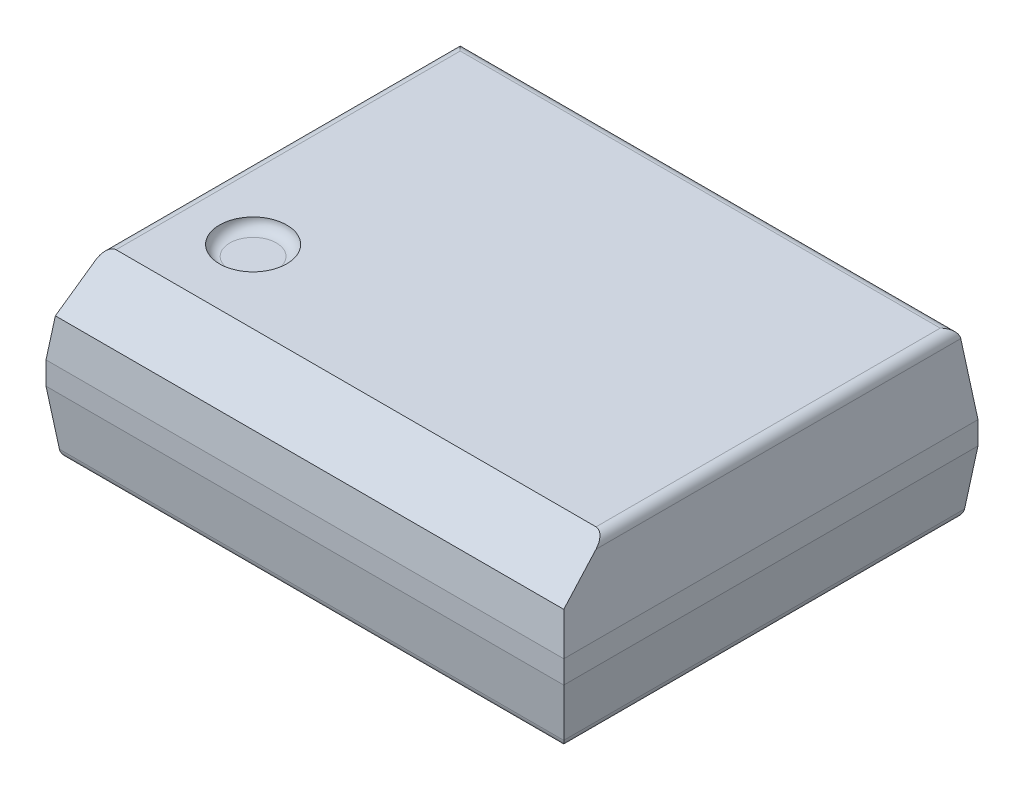
ISO-10303-21;
HEADER;
FILE_DESCRIPTION(('STEP AP214'),'2;1');
FILE_NAME('part.step','',(''),(''),'','','');
FILE_SCHEMA(('AUTOMOTIVE_DESIGN { 1 0 10303 214 1 1 1 1 }'));
ENDSEC;
DATA;
#1=APPLICATION_CONTEXT('core data for automotive mechanical design processes');
#2=APPLICATION_PROTOCOL_DEFINITION('international standard','automotive_design',2000,#1);
#3=PRODUCT_CONTEXT('',#1,'mechanical');
#4=PRODUCT('Part','Part','',(#3));
#5=PRODUCT_RELATED_PRODUCT_CATEGORY('part','',(#4));
#6=PRODUCT_DEFINITION_FORMATION('','',#4);
#7=PRODUCT_DEFINITION_CONTEXT('part definition',#1,'design');
#8=PRODUCT_DEFINITION('design','',#6,#7);
#9=PRODUCT_DEFINITION_SHAPE('','',#8);
#10=(LENGTH_UNIT() NAMED_UNIT(*) SI_UNIT(.MILLI.,.METRE.));
#11=(NAMED_UNIT(*) PLANE_ANGLE_UNIT() SI_UNIT($,.RADIAN.));
#12=(NAMED_UNIT(*) SI_UNIT($,.STERADIAN.) SOLID_ANGLE_UNIT());
#13=UNCERTAINTY_MEASURE_WITH_UNIT(LENGTH_MEASURE(1.E-05),#10,'distance_accuracy_value','');
#14=(GEOMETRIC_REPRESENTATION_CONTEXT(3) GLOBAL_UNCERTAINTY_ASSIGNED_CONTEXT((#13)) GLOBAL_UNIT_ASSIGNED_CONTEXT((#10,
#11,#12)) REPRESENTATION_CONTEXT('',''));
#15=CARTESIAN_POINT('',(0.,0.,0.));
#16=DIRECTION('',(0.,0.,1.));
#17=DIRECTION('',(1.,0.,0.));
#18=AXIS2_PLACEMENT_3D('',#15,#16,#17);
#19=CARTESIAN_POINT('',(-1.7,1.65,0.8));
#20=DIRECTION('',(0.,1.,0.));
#21=DIRECTION('',(0.,0.,1.));
#22=AXIS2_PLACEMENT_3D('',#19,#20,#21);
#23=PLANE('',#22);
#24=CARTESIAN_POINT('',(-1.7,1.65,0.8));
#25=DIRECTION('',(0.,-1.,0.));
#26=DIRECTION('',(1.,0.,0.));
#27=AXIS2_PLACEMENT_3D('',#24,#25,#26);
#28=CIRCLE('',#27,0.225);
#29=CARTESIAN_POINT('',(-1.475,1.65,0.8));
#30=VERTEX_POINT('',#29);
#31=EDGE_CURVE('E152',#30,#30,#28,.F.);
#32=ORIENTED_EDGE('',*,*,#31,.T.);
#33=EDGE_LOOP('',(#32));
#34=FACE_BOUND('',#33,.T.);
#35=ADVANCED_FACE('F16',(#34),#23,.T.);
#36=CARTESIAN_POINT('',(-1.7,1.75,0.8));
#37=DIRECTION('',(0.,1.,0.));
#38=DIRECTION('',(1.,0.,0.));
#39=AXIS2_PLACEMENT_3D('',#36,#37,#38);
#40=TOROIDAL_SURFACE('',#39,0.225,0.1);
#41=ORIENTED_EDGE('',*,*,#31,.F.);
#42=EDGE_LOOP('',(#41));
#43=FACE_BOUND('',#42,.T.);
#44=CARTESIAN_POINT('',(-1.7,1.75,0.8));
#45=DIRECTION('',(0.,1.,0.));
#46=DIRECTION('',(0.,0.,1.));
#47=AXIS2_PLACEMENT_3D('',#44,#45,#46);
#48=CIRCLE('',#47,0.325);
#49=CARTESIAN_POINT('',(-1.7,1.75,1.125));
#50=VERTEX_POINT('',#49);
#51=EDGE_CURVE('E20',#50,#50,#48,.F.);
#52=ORIENTED_EDGE('',*,*,#51,.F.);
#53=EDGE_LOOP('',(#52));
#54=FACE_BOUND('',#53,.T.);
#55=ADVANCED_FACE('F133',(#43,#54),#40,.F.);
#56=CARTESIAN_POINT('',(0.,1.75,0.));
#57=DIRECTION('',(0.,1.,0.));
#58=DIRECTION('',(0.,0.,1.));
#59=AXIS2_PLACEMENT_3D('',#56,#57,#58);
#60=PLANE('',#59);
#61=DIRECTION('',(0.,0.,1.));
#62=VECTOR('',#61,1.);
#63=CARTESIAN_POINT('',(2.31759728445368,1.75,0.));
#64=LINE('',#63,#62);
#65=CARTESIAN_POINT('',(2.31759728445368,1.75,-1.81759728445368));
#66=VERTEX_POINT('',#65);
#67=CARTESIAN_POINT('',(2.31759728445368,1.75,1.50606981090928));
#68=VERTEX_POINT('',#67);
#69=EDGE_CURVE('E87',#66,#68,#64,.T.);
#70=ORIENTED_EDGE('',*,*,#69,.F.);
#71=DIRECTION('',(1.,0.,0.));
#72=VECTOR('',#71,1.);
#73=CARTESIAN_POINT('',(0.,1.75,-1.81759728445368));
#74=LINE('',#73,#72);
#75=CARTESIAN_POINT('',(-2.31759728445368,1.75,-1.81759728445368));
#76=VERTEX_POINT('',#75);
#77=EDGE_CURVE('E103',#76,#66,#74,.T.);
#78=ORIENTED_EDGE('',*,*,#77,.F.);
#79=DIRECTION('',(0.,0.,-1.));
#80=VECTOR('',#79,1.);
#81=CARTESIAN_POINT('',(-2.31759728445368,1.75,0.));
#82=LINE('',#81,#80);
#83=CARTESIAN_POINT('',(-2.31759728445368,1.75,1.50606981090928));
#84=VERTEX_POINT('',#83);
#85=EDGE_CURVE('E89',#84,#76,#82,.T.);
#86=ORIENTED_EDGE('',*,*,#85,.F.);
#87=DIRECTION('',(1.,0.,0.));
#88=VECTOR('',#87,1.);
#89=CARTESIAN_POINT('',(0.,1.75,1.50606981090928));
#90=LINE('',#89,#88);
#91=EDGE_CURVE('E82',#68,#84,#90,.F.);
#92=ORIENTED_EDGE('',*,*,#91,.F.);
#93=EDGE_LOOP('',(#70,#78,#86,#92));
#94=FACE_BOUND('',#93,.T.);
#95=ORIENTED_EDGE('',*,*,#51,.T.);
#96=EDGE_LOOP('',(#95));
#97=FACE_BOUND('',#96,.T.);
#98=ADVANCED_FACE('F84',(#94,#97),#60,.T.);
#99=CARTESIAN_POINT('',(0.,1.55149076967174,1.73044367959031));
#100=DIRECTION('',(0.,0.748955720789002,0.662620048215738));
#101=DIRECTION('',(0.,-0.662620048215738,0.748955720789002));
#102=AXIS2_PLACEMENT_3D('',#99,#100,#101);
#103=PLANE('',#102);
#104=CARTESIAN_POINT('',(2.31759728445368,1.65,1.61909924954546));
#105=DIRECTION('',(0.,0.748955720789002,0.662620048215738));
#106=DIRECTION('',(0.,-0.662620048215738,0.748955720789002));
#107=AXIS2_PLACEMENT_3D('',#104,#105,#106);
#108=ELLIPSE('',#107,0.150916049505707,0.1);
#109=CARTESIAN_POINT('',(2.41685189961782,1.66218693434051,1.60532442607342));
#110=VERTEX_POINT('',#109);
#111=EDGE_CURVE('E94',#68,#110,#108,.F.);
#112=ORIENTED_EDGE('',*,*,#111,.F.);
#113=ORIENTED_EDGE('',*,*,#91,.T.);
#114=CARTESIAN_POINT('',(-2.31759728445368,1.65,1.61909924954546));
#115=DIRECTION('',(0.,0.748955720789002,0.662620048215738));
#116=DIRECTION('',(0.,0.662620048215738,-0.748955720789002));
#117=AXIS2_PLACEMENT_3D('',#114,#115,#116);
#118=ELLIPSE('',#117,0.150916049505707,0.1);
#119=CARTESIAN_POINT('',(-2.41685189961782,1.66218693434051,1.60532442607342));
#120=VERTEX_POINT('',#119);
#121=EDGE_CURVE('E111',#120,#84,#118,.F.);
#122=ORIENTED_EDGE('',*,*,#121,.F.);
#123=DIRECTION('',(-0.0810915667929949,-0.660437812349415,0.74648915183958));
#124=VECTOR('',#123,1.);
#125=CARTESIAN_POINT('',(-2.41685189961782,1.66218693434052,1.60532442607342));
#126=LINE('',#125,#124);
#127=CARTESIAN_POINT('',(-2.45481754827134,1.35298153934347,1.95481754827134));
#128=VERTEX_POINT('',#127);
#129=EDGE_CURVE('E161',#120,#128,#126,.T.);
#130=ORIENTED_EDGE('',*,*,#129,.T.);
#131=DIRECTION('',(1.,0.,0.));
#132=VECTOR('',#131,1.);
#133=CARTESIAN_POINT('',(0.,1.35298153934347,1.95481754827134));
#134=LINE('',#133,#132);
#135=CARTESIAN_POINT('',(2.45481754827134,1.35298153934347,1.95481754827134));
#136=VERTEX_POINT('',#135);
#137=EDGE_CURVE('E115',#136,#128,#134,.F.);
#138=ORIENTED_EDGE('',*,*,#137,.F.);
#139=DIRECTION('',(-0.0810915667929949,0.660437812349415,-0.74648915183958));
#140=VECTOR('',#139,1.);
#141=CARTESIAN_POINT('',(2.45481754827134,1.35298153934347,1.95481754827134));
#142=LINE('',#141,#140);
#143=EDGE_CURVE('E95',#136,#110,#142,.T.);
#144=ORIENTED_EDGE('',*,*,#143,.T.);
#145=EDGE_LOOP('',(#112,#113,#122,#130,#138,#144));
#146=FACE_BOUND('',#145,.T.);
#147=ADVANCED_FACE('F106',(#146),#103,.T.);
#148=CARTESIAN_POINT('',(2.31759728445368,1.65,0.));
#149=DIRECTION('',(0.,0.,1.));
#150=DIRECTION('',(0.,-1.,0.));
#151=AXIS2_PLACEMENT_3D('',#148,#149,#150);
#152=CYLINDRICAL_SURFACE('',#151,0.1);
#153=CARTESIAN_POINT('',(2.31759728445368,1.65,-1.81759728445368));
#154=DIRECTION('',(0.707106781186547,0.,0.707106781186547));
#155=DIRECTION('',(0.707106781186547,0.,-0.707106781186547));
#156=AXIS2_PLACEMENT_3D('',#153,#154,#155);
#157=ELLIPSE('',#156,0.14142135623731,0.1);
#158=CARTESIAN_POINT('',(2.41685189961782,1.66218693434051,-1.91685189961781));
#159=VERTEX_POINT('',#158);
#160=EDGE_CURVE('E102',#66,#159,#157,.F.);
#161=ORIENTED_EDGE('',*,*,#160,.F.);
#162=ORIENTED_EDGE('',*,*,#69,.T.);
#163=ORIENTED_EDGE('',*,*,#111,.T.);
#164=DIRECTION('',(0.,0.,1.));
#165=VECTOR('',#164,1.);
#166=CARTESIAN_POINT('',(2.41685189961782,1.66218693434051,0.));
#167=LINE('',#166,#165);
#168=EDGE_CURVE('E170',#159,#110,#167,.T.);
#169=ORIENTED_EDGE('',*,*,#168,.F.);
#170=EDGE_LOOP('',(#161,#162,#163,#169));
#171=FACE_BOUND('',#170,.T.);
#172=ADVANCED_FACE('F99',(#171),#152,.T.);
#173=CARTESIAN_POINT('',(0.,1.65,-1.81759728445368));
#174=DIRECTION('',(1.,0.,0.));
#175=DIRECTION('',(0.,1.,0.));
#176=AXIS2_PLACEMENT_3D('',#173,#174,#175);
#177=CYLINDRICAL_SURFACE('',#176,0.1);
#178=DIRECTION('',(1.,0.,0.));
#179=VECTOR('',#178,1.);
#180=CARTESIAN_POINT('',(0.,1.66218693434051,-1.91685189961782));
#181=LINE('',#180,#179);
#182=CARTESIAN_POINT('',(-2.41685189961781,1.66218693434051,-1.91685189961782));
#183=VERTEX_POINT('',#182);
#184=EDGE_CURVE('E179',#183,#159,#181,.T.);
#185=ORIENTED_EDGE('',*,*,#184,.F.);
#186=CARTESIAN_POINT('',(-2.31759728445368,1.65,-1.81759728445368));
#187=DIRECTION('',(0.707106781186547,0.,-0.707106781186547));
#188=DIRECTION('',(-0.707106781186547,0.,-0.707106781186547));
#189=AXIS2_PLACEMENT_3D('',#186,#187,#188);
#190=ELLIPSE('',#189,0.14142135623731,0.1);
#191=EDGE_CURVE('E113',#76,#183,#190,.F.);
#192=ORIENTED_EDGE('',*,*,#191,.F.);
#193=ORIENTED_EDGE('',*,*,#77,.T.);
#194=ORIENTED_EDGE('',*,*,#160,.T.);
#195=EDGE_LOOP('',(#185,#192,#193,#194));
#196=FACE_BOUND('',#195,.T.);
#197=ADVANCED_FACE('F514',(#196),#177,.T.);
#198=CARTESIAN_POINT('',(-2.31759728445368,1.65,0.));
#199=DIRECTION('',(0.,0.,-1.));
#200=DIRECTION('',(0.,1.,0.));
#201=AXIS2_PLACEMENT_3D('',#198,#199,#200);
#202=CYLINDRICAL_SURFACE('',#201,0.1);
#203=ORIENTED_EDGE('',*,*,#191,.T.);
#204=DIRECTION('',(0.,0.,1.));
#205=VECTOR('',#204,1.);
#206=CARTESIAN_POINT('',(-2.41685189961782,1.66218693434051,0.));
#207=LINE('',#206,#205);
#208=EDGE_CURVE('E174',#120,#183,#207,.F.);
#209=ORIENTED_EDGE('',*,*,#208,.F.);
#210=ORIENTED_EDGE('',*,*,#121,.T.);
#211=ORIENTED_EDGE('',*,*,#85,.T.);
#212=EDGE_LOOP('',(#203,#209,#210,#211));
#213=FACE_BOUND('',#212,.T.);
#214=ADVANCED_FACE('F506',(#213),#202,.T.);
#215=CARTESIAN_POINT('',(0.,1.3675,1.95303490545464));
#216=DIRECTION('',(0.,0.121869343405147,0.992546151641322));
#217=DIRECTION('',(0.,-0.992546151641322,0.121869343405147));
#218=AXIS2_PLACEMENT_3D('',#215,#216,#217);
#219=PLANE('',#218);
#220=DIRECTION('',(1.,0.,0.));
#221=VECTOR('',#220,1.);
#222=CARTESIAN_POINT('',(0.,0.985,2.));
#223=LINE('',#222,#221);
#224=CARTESIAN_POINT('',(2.5,0.985,2.));
#225=VERTEX_POINT('',#224);
#226=CARTESIAN_POINT('',(-2.5,0.985,2.));
#227=VERTEX_POINT('',#226);
#228=EDGE_CURVE('E199',#225,#227,#223,.F.);
#229=ORIENTED_EDGE('',*,*,#228,.F.);
#230=DIRECTION('',(0.120974291151353,-0.985256536015294,0.120974291151347));
#231=VECTOR('',#230,1.);
#232=CARTESIAN_POINT('',(2.45481754827134,1.35298153934347,1.95481754827134));
#233=LINE('',#232,#231);
#234=EDGE_CURVE('E172',#136,#225,#233,.T.);
#235=ORIENTED_EDGE('',*,*,#234,.F.);
#236=ORIENTED_EDGE('',*,*,#137,.T.);
#237=DIRECTION('',(0.120974291151353,0.985256536015294,-0.120974291151347));
#238=VECTOR('',#237,1.);
#239=CARTESIAN_POINT('',(-2.5,0.985,2.));
#240=LINE('',#239,#238);
#241=EDGE_CURVE('E204',#227,#128,#240,.T.);
#242=ORIENTED_EDGE('',*,*,#241,.F.);
#243=EDGE_LOOP('',(#229,#235,#236,#242));
#244=FACE_BOUND('',#243,.T.);
#245=ADVANCED_FACE('F360',(#244),#219,.T.);
#246=CARTESIAN_POINT('',(2.45303490545464,1.3675,0.));
#247=DIRECTION('',(0.992546151641322,0.121869343405147,0.));
#248=DIRECTION('',(-0.121869343405147,0.992546151641322,0.));
#249=AXIS2_PLACEMENT_3D('',#246,#247,#248);
#250=PLANE('',#249);
#251=DIRECTION('',(0.,0.,-1.));
#252=VECTOR('',#251,1.);
#253=CARTESIAN_POINT('',(2.5,0.985,0.));
#254=LINE('',#253,#252);
#255=CARTESIAN_POINT('',(2.5,0.985,-2.));
#256=VERTEX_POINT('',#255);
#257=EDGE_CURVE('E195',#256,#225,#254,.F.);
#258=ORIENTED_EDGE('',*,*,#257,.F.);
#259=DIRECTION('',(0.120974291151349,-0.985256536015294,-0.120974291151354));
#260=VECTOR('',#259,1.);
#261=CARTESIAN_POINT('',(2.41685189961782,1.66218693434051,-1.91685189961782));
#262=LINE('',#261,#260);
#263=EDGE_CURVE('E178',#159,#256,#262,.T.);
#264=ORIENTED_EDGE('',*,*,#263,.F.);
#265=ORIENTED_EDGE('',*,*,#168,.T.);
#266=ORIENTED_EDGE('',*,*,#143,.F.);
#267=ORIENTED_EDGE('',*,*,#234,.T.);
#268=EDGE_LOOP('',(#258,#264,#265,#266,#267));
#269=FACE_BOUND('',#268,.T.);
#270=ADVANCED_FACE('F356',(#269),#250,.T.);
#271=CARTESIAN_POINT('',(0.,1.3675,-1.95303490545464));
#272=DIRECTION('',(0.,0.121869343405147,-0.992546151641322));
#273=DIRECTION('',(0.,0.992546151641322,0.121869343405147));
#274=AXIS2_PLACEMENT_3D('',#271,#272,#273);
#275=PLANE('',#274);
#276=DIRECTION('',(-1.,0.,0.));
#277=VECTOR('',#276,1.);
#278=CARTESIAN_POINT('',(0.,0.985,-2.));
#279=LINE('',#278,#277);
#280=CARTESIAN_POINT('',(-2.5,0.985,-2.));
#281=VERTEX_POINT('',#280);
#282=EDGE_CURVE('E222',#281,#256,#279,.F.);
#283=ORIENTED_EDGE('',*,*,#282,.F.);
#284=DIRECTION('',(-0.120974291151354,-0.985256536015294,-0.12097429115135));
#285=VECTOR('',#284,1.);
#286=CARTESIAN_POINT('',(-2.41685189961782,1.66218693434051,-1.91685189961782));
#287=LINE('',#286,#285);
#288=EDGE_CURVE('E177',#183,#281,#287,.T.);
#289=ORIENTED_EDGE('',*,*,#288,.F.);
#290=ORIENTED_EDGE('',*,*,#184,.T.);
#291=ORIENTED_EDGE('',*,*,#263,.T.);
#292=EDGE_LOOP('',(#283,#289,#290,#291));
#293=FACE_BOUND('',#292,.T.);
#294=ADVANCED_FACE('F415',(#293),#275,.T.);
#295=CARTESIAN_POINT('',(-2.45303490545464,1.3675,0.));
#296=DIRECTION('',(-0.992546151641322,0.121869343405147,0.));
#297=DIRECTION('',(-0.121869343405147,-0.992546151641322,0.));
#298=AXIS2_PLACEMENT_3D('',#295,#296,#297);
#299=PLANE('',#298);
#300=ORIENTED_EDGE('',*,*,#241,.T.);
#301=ORIENTED_EDGE('',*,*,#129,.F.);
#302=ORIENTED_EDGE('',*,*,#208,.T.);
#303=ORIENTED_EDGE('',*,*,#288,.T.);
#304=DIRECTION('',(0.,0.,1.));
#305=VECTOR('',#304,1.);
#306=CARTESIAN_POINT('',(-2.5,0.985,0.));
#307=LINE('',#306,#305);
#308=EDGE_CURVE('E215',#227,#281,#307,.F.);
#309=ORIENTED_EDGE('',*,*,#308,.F.);
#310=EDGE_LOOP('',(#300,#301,#302,#303,#309));
#311=FACE_BOUND('',#310,.T.);
#312=ADVANCED_FACE('F418',(#311),#299,.T.);
#313=CARTESIAN_POINT('',(0.,0.15,2.));
#314=DIRECTION('',(0.,0.,1.));
#315=DIRECTION('',(1.,0.,0.));
#316=AXIS2_PLACEMENT_3D('',#313,#314,#315);
#317=PLANE('',#316);
#318=ORIENTED_EDGE('',*,*,#228,.T.);
#319=DIRECTION('',(0.,1.,0.));
#320=VECTOR('',#319,1.);
#321=CARTESIAN_POINT('',(-2.5,0.15,2.));
#322=LINE('',#321,#320);
#323=CARTESIAN_POINT('',(-2.5,0.765,2.));
#324=VERTEX_POINT('',#323);
#325=EDGE_CURVE('E219',#324,#227,#322,.T.);
#326=ORIENTED_EDGE('',*,*,#325,.F.);
#327=DIRECTION('',(1.,0.,0.));
#328=VECTOR('',#327,1.);
#329=CARTESIAN_POINT('',(0.,0.765,2.));
#330=LINE('',#329,#328);
#331=CARTESIAN_POINT('',(2.5,0.765,2.));
#332=VERTEX_POINT('',#331);
#333=EDGE_CURVE('E240',#332,#324,#330,.F.);
#334=ORIENTED_EDGE('',*,*,#333,.F.);
#335=DIRECTION('',(0.,1.,0.));
#336=VECTOR('',#335,1.);
#337=CARTESIAN_POINT('',(2.5,0.15,2.));
#338=LINE('',#337,#336);
#339=EDGE_CURVE('E198',#225,#332,#338,.F.);
#340=ORIENTED_EDGE('',*,*,#339,.F.);
#341=EDGE_LOOP('',(#318,#326,#334,#340));
#342=FACE_BOUND('',#341,.T.);
#343=ADVANCED_FACE('F330',(#342),#317,.T.);
#344=CARTESIAN_POINT('',(2.5,0.15,0.));
#345=DIRECTION('',(1.,0.,0.));
#346=DIRECTION('',(0.,0.,-1.));
#347=AXIS2_PLACEMENT_3D('',#344,#345,#346);
#348=PLANE('',#347);
#349=ORIENTED_EDGE('',*,*,#257,.T.);
#350=ORIENTED_EDGE('',*,*,#339,.T.);
#351=DIRECTION('',(0.,0.,1.));
#352=VECTOR('',#351,1.);
#353=CARTESIAN_POINT('',(2.5,0.765,0.));
#354=LINE('',#353,#352);
#355=CARTESIAN_POINT('',(2.5,0.765,-2.));
#356=VERTEX_POINT('',#355);
#357=EDGE_CURVE('E236',#356,#332,#354,.T.);
#358=ORIENTED_EDGE('',*,*,#357,.F.);
#359=DIRECTION('',(0.,1.,0.));
#360=VECTOR('',#359,1.);
#361=CARTESIAN_POINT('',(2.5,0.15,-2.));
#362=LINE('',#361,#360);
#363=EDGE_CURVE('E225',#256,#356,#362,.F.);
#364=ORIENTED_EDGE('',*,*,#363,.F.);
#365=EDGE_LOOP('',(#349,#350,#358,#364));
#366=FACE_BOUND('',#365,.T.);
#367=ADVANCED_FACE('F363',(#366),#348,.T.);
#368=CARTESIAN_POINT('',(0.,0.15,-2.));
#369=DIRECTION('',(0.,0.,-1.));
#370=DIRECTION('',(-1.,0.,0.));
#371=AXIS2_PLACEMENT_3D('',#368,#369,#370);
#372=PLANE('',#371);
#373=ORIENTED_EDGE('',*,*,#282,.T.);
#374=ORIENTED_EDGE('',*,*,#363,.T.);
#375=DIRECTION('',(1.,0.,0.));
#376=VECTOR('',#375,1.);
#377=CARTESIAN_POINT('',(0.,0.765,-2.));
#378=LINE('',#377,#376);
#379=CARTESIAN_POINT('',(-2.5,0.765,-2.));
#380=VERTEX_POINT('',#379);
#381=EDGE_CURVE('E262',#380,#356,#378,.T.);
#382=ORIENTED_EDGE('',*,*,#381,.F.);
#383=DIRECTION('',(0.,1.,0.));
#384=VECTOR('',#383,1.);
#385=CARTESIAN_POINT('',(-2.5,0.15,-2.));
#386=LINE('',#385,#384);
#387=EDGE_CURVE('E218',#281,#380,#386,.F.);
#388=ORIENTED_EDGE('',*,*,#387,.F.);
#389=EDGE_LOOP('',(#373,#374,#382,#388));
#390=FACE_BOUND('',#389,.T.);
#391=ADVANCED_FACE('F343',(#390),#372,.T.);
#392=CARTESIAN_POINT('',(-2.5,0.15,0.));
#393=DIRECTION('',(-1.,0.,0.));
#394=DIRECTION('',(0.,0.,1.));
#395=AXIS2_PLACEMENT_3D('',#392,#393,#394);
#396=PLANE('',#395);
#397=ORIENTED_EDGE('',*,*,#308,.T.);
#398=ORIENTED_EDGE('',*,*,#387,.T.);
#399=DIRECTION('',(0.,0.,1.));
#400=VECTOR('',#399,1.);
#401=CARTESIAN_POINT('',(-2.5,0.765,0.));
#402=LINE('',#401,#400);
#403=EDGE_CURVE('E255',#324,#380,#402,.F.);
#404=ORIENTED_EDGE('',*,*,#403,.F.);
#405=ORIENTED_EDGE('',*,*,#325,.T.);
#406=EDGE_LOOP('',(#397,#398,#404,#405));
#407=FACE_BOUND('',#406,.T.);
#408=ADVANCED_FACE('F336',(#407),#396,.T.);
#409=CARTESIAN_POINT('',(0.,0.4575,1.96224374752236));
#410=DIRECTION('',(0.,-0.121869343405147,0.992546151641322));
#411=DIRECTION('',(0.,-0.992546151641322,-0.121869343405147));
#412=AXIS2_PLACEMENT_3D('',#409,#410,#411);
#413=PLANE('',#412);
#414=ORIENTED_EDGE('',*,*,#333,.T.);
#415=DIRECTION('',(-0.120974291151354,0.985256536015293,0.120974291151357));
#416=VECTOR('',#415,1.);
#417=CARTESIAN_POINT('',(-2.43526958375325,0.237813065659484,1.93526958375325));
#418=LINE('',#417,#416);
#419=CARTESIAN_POINT('',(-2.43526958375325,0.237813065659485,1.93526958375325));
#420=VERTEX_POINT('',#419);
#421=EDGE_CURVE('E259',#420,#324,#418,.T.);
#422=ORIENTED_EDGE('',*,*,#421,.F.);
#423=DIRECTION('',(1.,0.,0.));
#424=VECTOR('',#423,1.);
#425=CARTESIAN_POINT('',(0.,0.237813065659485,1.93526958375325));
#426=LINE('',#425,#424);
#427=CARTESIAN_POINT('',(2.43526958375325,0.237813065659485,1.93526958375325));
#428=VERTEX_POINT('',#427);
#429=EDGE_CURVE('E276',#428,#420,#426,.F.);
#430=ORIENTED_EDGE('',*,*,#429,.F.);
#431=DIRECTION('',(-0.120974291151354,-0.985256536015293,-0.120974291151357));
#432=VECTOR('',#431,1.);
#433=CARTESIAN_POINT('',(2.5,0.765,2.));
#434=LINE('',#433,#432);
#435=EDGE_CURVE('E239',#332,#428,#434,.T.);
#436=ORIENTED_EDGE('',*,*,#435,.F.);
#437=EDGE_LOOP('',(#414,#422,#430,#436));
#438=FACE_BOUND('',#437,.T.);
#439=ADVANCED_FACE('F319',(#438),#413,.T.);
#440=CARTESIAN_POINT('',(2.46224374752236,0.4575,0.));
#441=DIRECTION('',(0.992546151641322,-0.121869343405147,0.));
#442=DIRECTION('',(0.121869343405147,0.992546151641322,0.));
#443=AXIS2_PLACEMENT_3D('',#440,#441,#442);
#444=PLANE('',#443);
#445=ORIENTED_EDGE('',*,*,#357,.T.);
#446=ORIENTED_EDGE('',*,*,#435,.T.);
#447=DIRECTION('',(0.,0.,-1.));
#448=VECTOR('',#447,1.);
#449=CARTESIAN_POINT('',(2.43526958375325,0.237813065659485,0.));
#450=LINE('',#449,#448);
#451=CARTESIAN_POINT('',(2.43526958375325,0.237813065659485,-1.93526958375325));
#452=VERTEX_POINT('',#451);
#453=EDGE_CURVE('E119',#452,#428,#450,.F.);
#454=ORIENTED_EDGE('',*,*,#453,.F.);
#455=DIRECTION('',(-0.120974291151357,-0.985256536015293,0.120974291151354));
#456=VECTOR('',#455,1.);
#457=CARTESIAN_POINT('',(2.5,0.765,-2.));
#458=LINE('',#457,#456);
#459=EDGE_CURVE('E265',#356,#452,#458,.T.);
#460=ORIENTED_EDGE('',*,*,#459,.F.);
#461=EDGE_LOOP('',(#445,#446,#454,#460));
#462=FACE_BOUND('',#461,.T.);
#463=ADVANCED_FACE('F366',(#462),#444,.T.);
#464=CARTESIAN_POINT('',(0.,0.4575,-1.96224374752236));
#465=DIRECTION('',(0.,-0.121869343405147,-0.992546151641322));
#466=DIRECTION('',(0.,0.992546151641322,-0.121869343405147));
#467=AXIS2_PLACEMENT_3D('',#464,#465,#466);
#468=PLANE('',#467);
#469=ORIENTED_EDGE('',*,*,#381,.T.);
#470=ORIENTED_EDGE('',*,*,#459,.T.);
#471=DIRECTION('',(-1.,0.,0.));
#472=VECTOR('',#471,1.);
#473=CARTESIAN_POINT('',(0.,0.237813065659485,-1.93526958375325));
#474=LINE('',#473,#472);
#475=CARTESIAN_POINT('',(-2.43526958375325,0.237813065659485,-1.93526958375325));
#476=VERTEX_POINT('',#475);
#477=EDGE_CURVE('E118',#476,#452,#474,.F.);
#478=ORIENTED_EDGE('',*,*,#477,.F.);
#479=DIRECTION('',(0.120974291151354,-0.985256536015293,0.120974291151357));
#480=VECTOR('',#479,1.);
#481=CARTESIAN_POINT('',(-2.5,0.765,-2.));
#482=LINE('',#481,#480);
#483=EDGE_CURVE('E258',#380,#476,#482,.T.);
#484=ORIENTED_EDGE('',*,*,#483,.F.);
#485=EDGE_LOOP('',(#469,#470,#478,#484));
#486=FACE_BOUND('',#485,.T.);
#487=ADVANCED_FACE('F301',(#486),#468,.T.);
#488=CARTESIAN_POINT('',(-2.46224374752236,0.4575,0.));
#489=DIRECTION('',(-0.992546151641322,-0.121869343405147,0.));
#490=DIRECTION('',(0.121869343405147,-0.992546151641322,0.));
#491=AXIS2_PLACEMENT_3D('',#488,#489,#490);
#492=PLANE('',#491);
#493=ORIENTED_EDGE('',*,*,#403,.T.);
#494=ORIENTED_EDGE('',*,*,#483,.T.);
#495=DIRECTION('',(0.,0.,1.));
#496=VECTOR('',#495,1.);
#497=CARTESIAN_POINT('',(-2.43526958375325,0.237813065659485,0.));
#498=LINE('',#497,#496);
#499=EDGE_CURVE('E125',#420,#476,#498,.F.);
#500=ORIENTED_EDGE('',*,*,#499,.F.);
#501=ORIENTED_EDGE('',*,*,#421,.T.);
#502=EDGE_LOOP('',(#493,#494,#500,#501));
#503=FACE_BOUND('',#502,.T.);
#504=ADVANCED_FACE('F324',(#503),#492,.T.);
#505=CARTESIAN_POINT('',(0.,0.25,1.83601496858912));
#506=DIRECTION('',(1.,0.,0.));
#507=DIRECTION('',(0.,1.,0.));
#508=AXIS2_PLACEMENT_3D('',#505,#506,#507);
#509=CYLINDRICAL_SURFACE('',#508,0.1);
#510=ORIENTED_EDGE('',*,*,#429,.T.);
#511=CARTESIAN_POINT('',(-2.33601496858912,0.25,1.83601496858912));
#512=DIRECTION('',(0.707106781186547,0.,0.707106781186547));
#513=DIRECTION('',(-0.707106781186547,0.,0.707106781186547));
#514=AXIS2_PLACEMENT_3D('',#511,#512,#513);
#515=ELLIPSE('',#514,0.14142135623731,0.1);
#516=CARTESIAN_POINT('',(-2.33601496858912,0.15,1.83601496858912));
#517=VERTEX_POINT('',#516);
#518=EDGE_CURVE('E122',#517,#420,#515,.F.);
#519=ORIENTED_EDGE('',*,*,#518,.F.);
#520=DIRECTION('',(1.,0.,0.));
#521=VECTOR('',#520,1.);
#522=CARTESIAN_POINT('',(0.,0.15,1.83601496858912));
#523=LINE('',#522,#521);
#524=CARTESIAN_POINT('',(2.33601496858912,0.15,1.83601496858912));
#525=VERTEX_POINT('',#524);
#526=EDGE_CURVE('E127',#517,#525,#523,.T.);
#527=ORIENTED_EDGE('',*,*,#526,.T.);
#528=CARTESIAN_POINT('',(2.33601496858912,0.25,1.83601496858912));
#529=DIRECTION('',(0.707106781186547,0.,-0.707106781186547));
#530=DIRECTION('',(-0.707106781186547,0.,-0.707106781186547));
#531=AXIS2_PLACEMENT_3D('',#528,#529,#530);
#532=ELLIPSE('',#531,0.14142135623731,0.1);
#533=EDGE_CURVE('E116',#428,#525,#532,.T.);
#534=ORIENTED_EDGE('',*,*,#533,.F.);
#535=EDGE_LOOP('',(#510,#519,#527,#534));
#536=FACE_BOUND('',#535,.T.);
#537=ADVANCED_FACE('F316',(#536),#509,.T.);
#538=CARTESIAN_POINT('',(2.33601496858912,0.25,0.));
#539=DIRECTION('',(0.,0.,-1.));
#540=DIRECTION('',(0.,1.,0.));
#541=AXIS2_PLACEMENT_3D('',#538,#539,#540);
#542=CYLINDRICAL_SURFACE('',#541,0.1);
#543=ORIENTED_EDGE('',*,*,#453,.T.);
#544=ORIENTED_EDGE('',*,*,#533,.T.);
#545=DIRECTION('',(0.,0.,1.));
#546=VECTOR('',#545,1.);
#547=CARTESIAN_POINT('',(2.33601496858912,0.15,0.));
#548=LINE('',#547,#546);
#549=CARTESIAN_POINT('',(2.33601496858912,0.15,-1.83601496858912));
#550=VERTEX_POINT('',#549);
#551=EDGE_CURVE('E284',#525,#550,#548,.F.);
#552=ORIENTED_EDGE('',*,*,#551,.T.);
#553=CARTESIAN_POINT('',(2.33601496858912,0.25,-1.83601496858912));
#554=DIRECTION('',(-0.707106781186547,0.,-0.707106781186547));
#555=DIRECTION('',(-0.707106781186547,0.,0.707106781186547));
#556=AXIS2_PLACEMENT_3D('',#553,#554,#555);
#557=ELLIPSE('',#556,0.14142135623731,0.1);
#558=EDGE_CURVE('E120',#452,#550,#557,.T.);
#559=ORIENTED_EDGE('',*,*,#558,.F.);
#560=EDGE_LOOP('',(#543,#544,#552,#559));
#561=FACE_BOUND('',#560,.T.);
#562=ADVANCED_FACE('F312',(#561),#542,.T.);
#563=CARTESIAN_POINT('',(0.,0.25,-1.83601496858912));
#564=DIRECTION('',(-1.,0.,0.));
#565=DIRECTION('',(0.,-1.,0.));
#566=AXIS2_PLACEMENT_3D('',#563,#564,#565);
#567=CYLINDRICAL_SURFACE('',#566,0.1);
#568=ORIENTED_EDGE('',*,*,#477,.T.);
#569=ORIENTED_EDGE('',*,*,#558,.T.);
#570=DIRECTION('',(1.,0.,0.));
#571=VECTOR('',#570,1.);
#572=CARTESIAN_POINT('',(0.,0.15,-1.83601496858912));
#573=LINE('',#572,#571);
#574=CARTESIAN_POINT('',(-2.33601496858912,0.15,-1.83601496858912));
#575=VERTEX_POINT('',#574);
#576=EDGE_CURVE('E26',#550,#575,#573,.F.);
#577=ORIENTED_EDGE('',*,*,#576,.T.);
#578=CARTESIAN_POINT('',(-2.33601496858912,0.25,-1.83601496858912));
#579=DIRECTION('',(-0.707106781186547,0.,0.707106781186547));
#580=DIRECTION('',(0.707106781186547,0.,0.707106781186547));
#581=AXIS2_PLACEMENT_3D('',#578,#579,#580);
#582=ELLIPSE('',#581,0.14142135623731,0.1);
#583=EDGE_CURVE('E34',#476,#575,#582,.T.);
#584=ORIENTED_EDGE('',*,*,#583,.F.);
#585=EDGE_LOOP('',(#568,#569,#577,#584));
#586=FACE_BOUND('',#585,.T.);
#587=ADVANCED_FACE('F305',(#586),#567,.T.);
#588=CARTESIAN_POINT('',(-2.33601496858912,0.25,0.));
#589=DIRECTION('',(0.,0.,1.));
#590=DIRECTION('',(0.,-1.,0.));
#591=AXIS2_PLACEMENT_3D('',#588,#589,#590);
#592=CYLINDRICAL_SURFACE('',#591,0.1);
#593=ORIENTED_EDGE('',*,*,#499,.T.);
#594=ORIENTED_EDGE('',*,*,#583,.T.);
#595=DIRECTION('',(0.,0.,1.));
#596=VECTOR('',#595,1.);
#597=CARTESIAN_POINT('',(-2.33601496858912,0.15,0.));
#598=LINE('',#597,#596);
#599=EDGE_CURVE('E11',#575,#517,#598,.T.);
#600=ORIENTED_EDGE('',*,*,#599,.T.);
#601=ORIENTED_EDGE('',*,*,#518,.T.);
#602=EDGE_LOOP('',(#593,#594,#600,#601));
#603=FACE_BOUND('',#602,.T.);
#604=ADVANCED_FACE('F295',(#603),#592,.T.);
#605=CARTESIAN_POINT('',(0.,0.15,0.));
#606=DIRECTION('',(0.,1.,0.));
#607=DIRECTION('',(0.,0.,1.));
#608=AXIS2_PLACEMENT_3D('',#605,#606,#607);
#609=PLANE('',#608);
#610=ORIENTED_EDGE('',*,*,#576,.F.);
#611=ORIENTED_EDGE('',*,*,#551,.F.);
#612=ORIENTED_EDGE('',*,*,#526,.F.);
#613=ORIENTED_EDGE('',*,*,#599,.F.);
#614=EDGE_LOOP('',(#610,#611,#612,#613));
#615=FACE_BOUND('',#614,.T.);
#616=ADVANCED_FACE('F310',(#615),#609,.F.);
#617=CLOSED_SHELL('',(#35,#55,#98,#147,#172,#197,#214,#245,#270,#294,#312,#343,#367,#391,#408,
#439,#463,#487,#504,#537,#562,#587,#604,#616));
#618=MANIFOLD_SOLID_BREP('B1',#617);
#619=ADVANCED_BREP_SHAPE_REPRESENTATION('',(#18,#618),#14);
#620=SHAPE_DEFINITION_REPRESENTATION(#9,#619);
ENDSEC;
END-ISO-10303-21;
